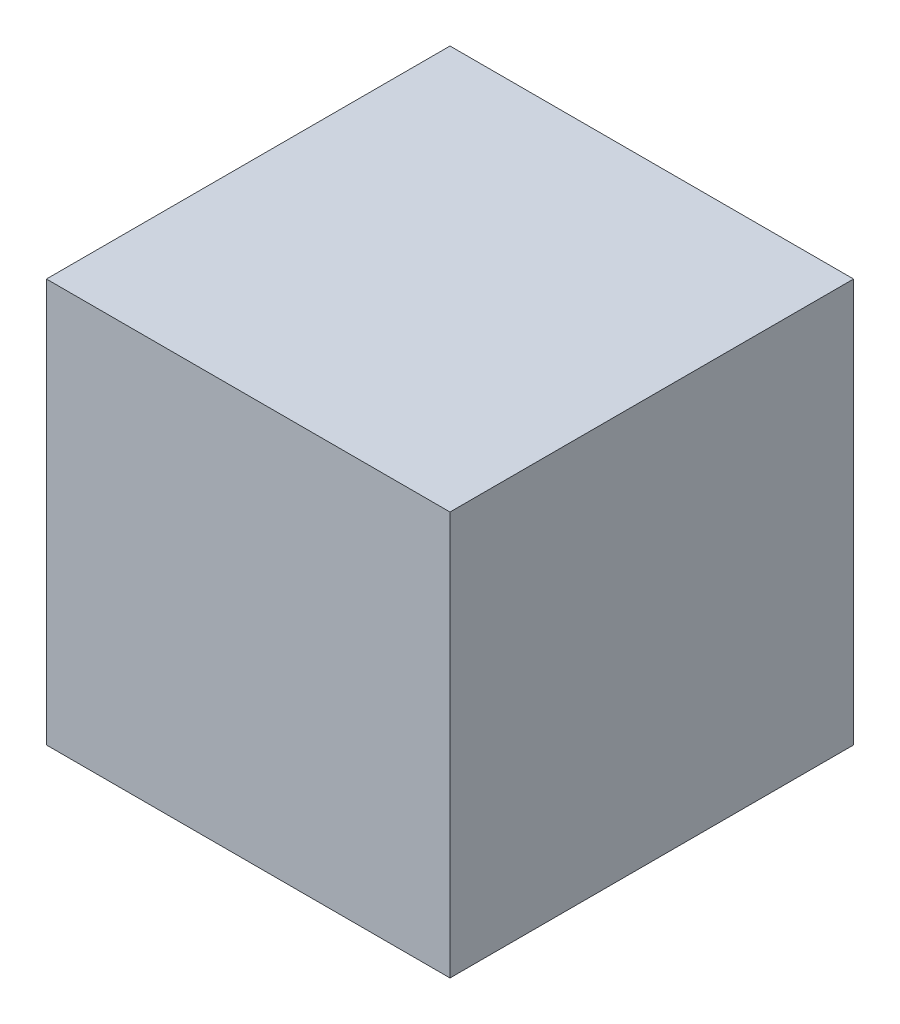
ISO-10303-21;
HEADER;
FILE_DESCRIPTION(('STEP AP214'),'2;1');
FILE_NAME('part.step','',(''),(''),'','','');
FILE_SCHEMA(('AUTOMOTIVE_DESIGN { 1 0 10303 214 1 1 1 1 }'));
ENDSEC;
DATA;
#1=APPLICATION_CONTEXT('core data for automotive mechanical design processes');
#2=APPLICATION_PROTOCOL_DEFINITION('international standard','automotive_design',2000,#1);
#3=PRODUCT_CONTEXT('',#1,'mechanical');
#4=PRODUCT('Part','Part','',(#3));
#5=PRODUCT_RELATED_PRODUCT_CATEGORY('part','',(#4));
#6=PRODUCT_DEFINITION_FORMATION('','',#4);
#7=PRODUCT_DEFINITION_CONTEXT('part definition',#1,'design');
#8=PRODUCT_DEFINITION('design','',#6,#7);
#9=PRODUCT_DEFINITION_SHAPE('','',#8);
#10=(LENGTH_UNIT() NAMED_UNIT(*) SI_UNIT(.MILLI.,.METRE.));
#11=(NAMED_UNIT(*) PLANE_ANGLE_UNIT() SI_UNIT($,.RADIAN.));
#12=(NAMED_UNIT(*) SI_UNIT($,.STERADIAN.) SOLID_ANGLE_UNIT());
#13=UNCERTAINTY_MEASURE_WITH_UNIT(LENGTH_MEASURE(1.E-05),#10,'distance_accuracy_value','');
#14=(GEOMETRIC_REPRESENTATION_CONTEXT(3) GLOBAL_UNCERTAINTY_ASSIGNED_CONTEXT((#13)) GLOBAL_UNIT_ASSIGNED_CONTEXT((#10,
#11,#12)) REPRESENTATION_CONTEXT('',''));
#15=CARTESIAN_POINT('',(0.,0.,0.));
#16=DIRECTION('',(0.,0.,1.));
#17=DIRECTION('',(1.,0.,0.));
#18=AXIS2_PLACEMENT_3D('',#15,#16,#17);
#19=CARTESIAN_POINT('',(-10.,10.,200.));
#20=DIRECTION('',(1.,0.,0.));
#21=DIRECTION('',(0.,1.,0.));
#22=AXIS2_PLACEMENT_3D('',#19,#20,#21);
#23=PLANE('',#22);
#24=DIRECTION('',(0.,-1.,0.));
#25=VECTOR('',#24,1.);
#26=CARTESIAN_POINT('',(-10.,10.,0.));
#27=LINE('',#26,#25);
#28=CARTESIAN_POINT('',(-10.,10.,0.));
#29=VERTEX_POINT('',#28);
#30=CARTESIAN_POINT('',(-9.99999999999998,-190.,0.));
#31=VERTEX_POINT('',#30);
#32=EDGE_CURVE('E96',#29,#31,#27,.T.);
#33=ORIENTED_EDGE('',*,*,#32,.T.);
#34=DIRECTION('',(0.,0.,-1.));
#35=VECTOR('',#34,1.);
#36=CARTESIAN_POINT('',(-9.99999999999998,-190.,200.));
#37=LINE('',#36,#35);
#38=CARTESIAN_POINT('',(-9.99999999999998,-190.,200.));
#39=VERTEX_POINT('',#38);
#40=EDGE_CURVE('E11',#39,#31,#37,.T.);
#41=ORIENTED_EDGE('',*,*,#40,.F.);
#42=DIRECTION('',(0.,-1.,0.));
#43=VECTOR('',#42,1.);
#44=CARTESIAN_POINT('',(-10.,10.,200.));
#45=LINE('',#44,#43);
#46=CARTESIAN_POINT('',(-10.,10.,200.));
#47=VERTEX_POINT('',#46);
#48=EDGE_CURVE('E84',#47,#39,#45,.T.);
#49=ORIENTED_EDGE('',*,*,#48,.F.);
#50=DIRECTION('',(0.,0.,-1.));
#51=VECTOR('',#50,1.);
#52=CARTESIAN_POINT('',(-10.,10.,200.));
#53=LINE('',#52,#51);
#54=EDGE_CURVE('E92',#47,#29,#53,.T.);
#55=ORIENTED_EDGE('',*,*,#54,.T.);
#56=EDGE_LOOP('',(#33,#41,#49,#55));
#57=FACE_BOUND('',#56,.T.);
#58=ADVANCED_FACE('F33',(#57),#23,.F.);
#59=CARTESIAN_POINT('',(-9.99999999999998,-190.,200.));
#60=DIRECTION('',(0.,1.,0.));
#61=DIRECTION('',(0.,0.,1.));
#62=AXIS2_PLACEMENT_3D('',#59,#60,#61);
#63=PLANE('',#62);
#64=DIRECTION('',(1.,0.,0.));
#65=VECTOR('',#64,1.);
#66=CARTESIAN_POINT('',(-9.99999999999998,-190.,0.));
#67=LINE('',#66,#65);
#68=CARTESIAN_POINT('',(190.,-190.,0.));
#69=VERTEX_POINT('',#68);
#70=EDGE_CURVE('E88',#31,#69,#67,.T.);
#71=ORIENTED_EDGE('',*,*,#70,.T.);
#72=DIRECTION('',(0.,0.,-1.));
#73=VECTOR('',#72,1.);
#74=CARTESIAN_POINT('',(190.,-190.,200.));
#75=LINE('',#74,#73);
#76=CARTESIAN_POINT('',(190.,-190.,200.));
#77=VERTEX_POINT('',#76);
#78=EDGE_CURVE('E41',#77,#69,#75,.T.);
#79=ORIENTED_EDGE('',*,*,#78,.F.);
#80=DIRECTION('',(1.,0.,0.));
#81=VECTOR('',#80,1.);
#82=CARTESIAN_POINT('',(-9.99999999999998,-190.,200.));
#83=LINE('',#82,#81);
#84=EDGE_CURVE('E79',#39,#77,#83,.T.);
#85=ORIENTED_EDGE('',*,*,#84,.F.);
#86=ORIENTED_EDGE('',*,*,#40,.T.);
#87=EDGE_LOOP('',(#71,#79,#85,#86));
#88=FACE_BOUND('',#87,.T.);
#89=ADVANCED_FACE('F87',(#88),#63,.F.);
#90=CARTESIAN_POINT('',(190.,-190.,200.));
#91=DIRECTION('',(-1.,0.,0.));
#92=DIRECTION('',(0.,0.,1.));
#93=AXIS2_PLACEMENT_3D('',#90,#91,#92);
#94=PLANE('',#93);
#95=DIRECTION('',(0.,1.,0.));
#96=VECTOR('',#95,1.);
#97=CARTESIAN_POINT('',(190.,-190.,0.));
#98=LINE('',#97,#96);
#99=CARTESIAN_POINT('',(190.,10.,0.));
#100=VERTEX_POINT('',#99);
#101=EDGE_CURVE('E66',#69,#100,#98,.T.);
#102=ORIENTED_EDGE('',*,*,#101,.T.);
#103=DIRECTION('',(0.,0.,-1.));
#104=VECTOR('',#103,1.);
#105=CARTESIAN_POINT('',(190.,10.,200.));
#106=LINE('',#105,#104);
#107=CARTESIAN_POINT('',(190.,10.,200.));
#108=VERTEX_POINT('',#107);
#109=EDGE_CURVE('E89',#108,#100,#106,.T.);
#110=ORIENTED_EDGE('',*,*,#109,.F.);
#111=DIRECTION('',(0.,1.,0.));
#112=VECTOR('',#111,1.);
#113=CARTESIAN_POINT('',(190.,-190.,200.));
#114=LINE('',#113,#112);
#115=EDGE_CURVE('E82',#77,#108,#114,.T.);
#116=ORIENTED_EDGE('',*,*,#115,.F.);
#117=ORIENTED_EDGE('',*,*,#78,.T.);
#118=EDGE_LOOP('',(#102,#110,#116,#117));
#119=FACE_BOUND('',#118,.T.);
#120=ADVANCED_FACE('F90',(#119),#94,.F.);
#121=CARTESIAN_POINT('',(-10.,10.,200.));
#122=DIRECTION('',(0.,-1.,0.));
#123=DIRECTION('',(0.,0.,-1.));
#124=AXIS2_PLACEMENT_3D('',#121,#122,#123);
#125=PLANE('',#124);
#126=DIRECTION('',(-1.,0.,0.));
#127=VECTOR('',#126,1.);
#128=CARTESIAN_POINT('',(-10.,10.,0.));
#129=LINE('',#128,#127);
#130=EDGE_CURVE('E72',#100,#29,#129,.T.);
#131=ORIENTED_EDGE('',*,*,#130,.T.);
#132=ORIENTED_EDGE('',*,*,#54,.F.);
#133=DIRECTION('',(-1.,0.,0.));
#134=VECTOR('',#133,1.);
#135=CARTESIAN_POINT('',(-10.,10.,200.));
#136=LINE('',#135,#134);
#137=EDGE_CURVE('E49',#108,#47,#136,.T.);
#138=ORIENTED_EDGE('',*,*,#137,.F.);
#139=ORIENTED_EDGE('',*,*,#109,.T.);
#140=EDGE_LOOP('',(#131,#132,#138,#139));
#141=FACE_BOUND('',#140,.T.);
#142=ADVANCED_FACE('F103',(#141),#125,.F.);
#143=CARTESIAN_POINT('',(0.,0.,200.));
#144=DIRECTION('',(0.,0.,1.));
#145=DIRECTION('',(1.,0.,0.));
#146=AXIS2_PLACEMENT_3D('',#143,#144,#145);
#147=PLANE('',#146);
#148=ORIENTED_EDGE('',*,*,#48,.T.);
#149=ORIENTED_EDGE('',*,*,#84,.T.);
#150=ORIENTED_EDGE('',*,*,#115,.T.);
#151=ORIENTED_EDGE('',*,*,#137,.T.);
#152=EDGE_LOOP('',(#148,#149,#150,#151));
#153=FACE_BOUND('',#152,.T.);
#154=ADVANCED_FACE('F80',(#153),#147,.T.);
#155=CARTESIAN_POINT('',(0.,0.,0.));
#156=DIRECTION('',(0.,0.,1.));
#157=DIRECTION('',(1.,0.,0.));
#158=AXIS2_PLACEMENT_3D('',#155,#156,#157);
#159=PLANE('',#158);
#160=ORIENTED_EDGE('',*,*,#32,.F.);
#161=ORIENTED_EDGE('',*,*,#130,.F.);
#162=ORIENTED_EDGE('',*,*,#101,.F.);
#163=ORIENTED_EDGE('',*,*,#70,.F.);
#164=EDGE_LOOP('',(#160,#161,#162,#163));
#165=FACE_BOUND('',#164,.T.);
#166=ADVANCED_FACE('F106',(#165),#159,.F.);
#167=CLOSED_SHELL('',(#58,#89,#120,#142,#154,#166));
#168=MANIFOLD_SOLID_BREP('B2',#167);
#169=ADVANCED_BREP_SHAPE_REPRESENTATION('',(#18,#168),#14);
#170=SHAPE_DEFINITION_REPRESENTATION(#9,#169);
ENDSEC;
END-ISO-10303-21;
